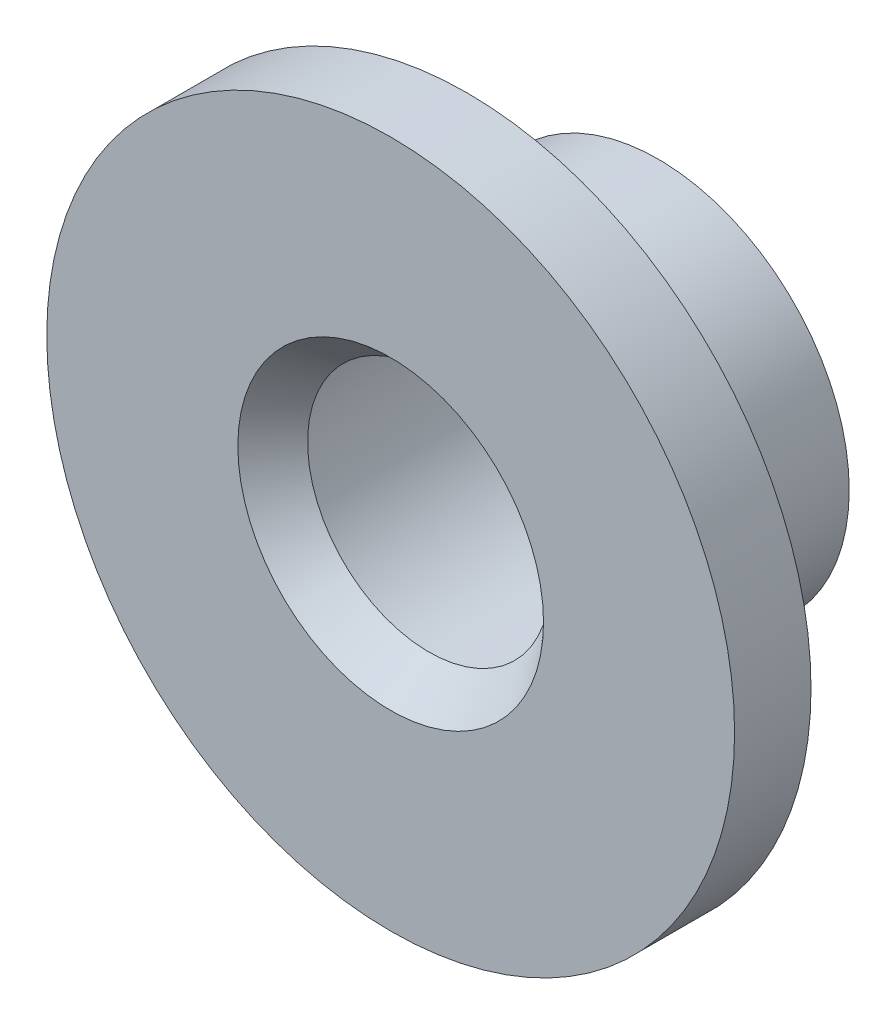
ISO-10303-21;
HEADER;
FILE_DESCRIPTION(('STEP AP214'),'2;1');
FILE_NAME('part.step','',(''),(''),'','','');
FILE_SCHEMA(('AUTOMOTIVE_DESIGN { 1 0 10303 214 1 1 1 1 }'));
ENDSEC;
DATA;
#1=APPLICATION_CONTEXT('core data for automotive mechanical design processes');
#2=APPLICATION_PROTOCOL_DEFINITION('international standard','automotive_design',2000,#1);
#3=PRODUCT_CONTEXT('',#1,'mechanical');
#4=PRODUCT('Part','Part','',(#3));
#5=PRODUCT_RELATED_PRODUCT_CATEGORY('part','',(#4));
#6=PRODUCT_DEFINITION_FORMATION('','',#4);
#7=PRODUCT_DEFINITION_CONTEXT('part definition',#1,'design');
#8=PRODUCT_DEFINITION('design','',#6,#7);
#9=PRODUCT_DEFINITION_SHAPE('','',#8);
#10=(LENGTH_UNIT() NAMED_UNIT(*) SI_UNIT(.MILLI.,.METRE.));
#11=(NAMED_UNIT(*) PLANE_ANGLE_UNIT() SI_UNIT($,.RADIAN.));
#12=(NAMED_UNIT(*) SI_UNIT($,.STERADIAN.) SOLID_ANGLE_UNIT());
#13=UNCERTAINTY_MEASURE_WITH_UNIT(LENGTH_MEASURE(1.E-05),#10,'distance_accuracy_value','');
#14=(GEOMETRIC_REPRESENTATION_CONTEXT(3) GLOBAL_UNCERTAINTY_ASSIGNED_CONTEXT((#13)) GLOBAL_UNIT_ASSIGNED_CONTEXT((#10,
#11,#12)) REPRESENTATION_CONTEXT('',''));
#15=CARTESIAN_POINT('',(0.,0.,0.));
#16=DIRECTION('',(0.,0.,1.));
#17=DIRECTION('',(1.,0.,0.));
#18=AXIS2_PLACEMENT_3D('',#15,#16,#17);
#19=CARTESIAN_POINT('',(0.,0.,0.));
#20=DIRECTION('',(0.,0.,1.));
#21=DIRECTION('',(1.,0.,0.));
#22=AXIS2_PLACEMENT_3D('',#19,#20,#21);
#23=CYLINDRICAL_SURFACE('',#22,18.);
#24=CARTESIAN_POINT('',(0.,0.,0.));
#25=DIRECTION('',(0.,0.,1.));
#26=DIRECTION('',(1.,0.,0.));
#27=AXIS2_PLACEMENT_3D('',#24,#25,#26);
#28=CIRCLE('',#27,18.);
#29=CARTESIAN_POINT('',(18.,0.,0.));
#30=VERTEX_POINT('',#29);
#31=EDGE_CURVE('E10',#30,#30,#28,.T.);
#32=ORIENTED_EDGE('',*,*,#31,.F.);
#33=EDGE_LOOP('',(#32));
#34=FACE_BOUND('',#33,.T.);
#35=CARTESIAN_POINT('',(0.,0.,-4.));
#36=DIRECTION('',(0.,0.,1.));
#37=DIRECTION('',(1.,0.,0.));
#38=AXIS2_PLACEMENT_3D('',#35,#36,#37);
#39=CIRCLE('',#38,18.);
#40=CARTESIAN_POINT('',(18.,0.,-4.));
#41=VERTEX_POINT('',#40);
#42=EDGE_CURVE('E60',#41,#41,#39,.T.);
#43=ORIENTED_EDGE('',*,*,#42,.T.);
#44=EDGE_LOOP('',(#43));
#45=FACE_BOUND('',#44,.T.);
#46=ADVANCED_FACE('F32',(#34,#45),#23,.T.);
#47=CARTESIAN_POINT('',(0.,18.,0.));
#48=DIRECTION('',(0.,0.,-1.));
#49=DIRECTION('',(-1.,0.,0.));
#50=AXIS2_PLACEMENT_3D('',#47,#48,#49);
#51=PLANE('',#50);
#52=CARTESIAN_POINT('',(0.,0.,0.));
#53=DIRECTION('',(0.,0.,1.));
#54=DIRECTION('',(1.,0.,0.));
#55=AXIS2_PLACEMENT_3D('',#52,#53,#54);
#56=CIRCLE('',#55,8.);
#57=CARTESIAN_POINT('',(8.,0.,0.));
#58=VERTEX_POINT('',#57);
#59=EDGE_CURVE('E38',#58,#58,#56,.T.);
#60=ORIENTED_EDGE('',*,*,#59,.F.);
#61=EDGE_LOOP('',(#60));
#62=FACE_BOUND('',#61,.T.);
#63=ORIENTED_EDGE('',*,*,#31,.T.);
#64=EDGE_LOOP('',(#63));
#65=FACE_BOUND('',#64,.T.);
#66=ADVANCED_FACE('F97',(#62,#65),#51,.F.);
#67=CARTESIAN_POINT('',(0.,0.,0.));
#68=DIRECTION('',(0.,0.,1.));
#69=DIRECTION('',(1.,0.,0.));
#70=AXIS2_PLACEMENT_3D('',#67,#68,#69);
#71=CONICAL_SURFACE('',#70,8.,0.689800044733608);
#72=CARTESIAN_POINT('',(0.,0.,-2.));
#73=DIRECTION('',(0.,0.,1.));
#74=DIRECTION('',(1.,0.,0.));
#75=AXIS2_PLACEMENT_3D('',#72,#73,#74);
#76=CIRCLE('',#75,6.35);
#77=CARTESIAN_POINT('',(6.35,0.,-2.));
#78=VERTEX_POINT('',#77);
#79=EDGE_CURVE('E42',#78,#78,#76,.T.);
#80=ORIENTED_EDGE('',*,*,#79,.F.);
#81=EDGE_LOOP('',(#80));
#82=FACE_BOUND('',#81,.T.);
#83=ORIENTED_EDGE('',*,*,#59,.T.);
#84=EDGE_LOOP('',(#83));
#85=FACE_BOUND('',#84,.T.);
#86=ADVANCED_FACE('F92',(#82,#85),#71,.F.);
#87=CARTESIAN_POINT('',(0.,6.35,-2.));
#88=DIRECTION('',(0.,0.,1.));
#89=DIRECTION('',(1.,0.,0.));
#90=AXIS2_PLACEMENT_3D('',#87,#88,#89);
#91=PLANE('',#90);
#92=CARTESIAN_POINT('',(0.,0.,-2.));
#93=DIRECTION('',(0.,0.,1.));
#94=DIRECTION('',(1.,0.,0.));
#95=AXIS2_PLACEMENT_3D('',#92,#93,#94);
#96=CIRCLE('',#95,8.);
#97=CARTESIAN_POINT('',(8.,0.,-2.));
#98=VERTEX_POINT('',#97);
#99=EDGE_CURVE('E46',#98,#98,#96,.T.);
#100=ORIENTED_EDGE('',*,*,#99,.F.);
#101=EDGE_LOOP('',(#100));
#102=FACE_BOUND('',#101,.T.);
#103=ORIENTED_EDGE('',*,*,#79,.T.);
#104=EDGE_LOOP('',(#103));
#105=FACE_BOUND('',#104,.T.);
#106=ADVANCED_FACE('F86',(#102,#105),#91,.F.);
#107=CARTESIAN_POINT('',(0.,0.,0.));
#108=DIRECTION('',(0.,0.,1.));
#109=DIRECTION('',(1.,0.,0.));
#110=AXIS2_PLACEMENT_3D('',#107,#108,#109);
#111=CYLINDRICAL_SURFACE('',#110,8.);
#112=CARTESIAN_POINT('',(0.,0.,-14.));
#113=DIRECTION('',(0.,0.,1.));
#114=DIRECTION('',(1.,0.,0.));
#115=AXIS2_PLACEMENT_3D('',#112,#113,#114);
#116=CIRCLE('',#115,8.);
#117=CARTESIAN_POINT('',(8.,0.,-14.));
#118=VERTEX_POINT('',#117);
#119=EDGE_CURVE('E51',#118,#118,#116,.T.);
#120=ORIENTED_EDGE('',*,*,#119,.F.);
#121=EDGE_LOOP('',(#120));
#122=FACE_BOUND('',#121,.T.);
#123=ORIENTED_EDGE('',*,*,#99,.T.);
#124=EDGE_LOOP('',(#123));
#125=FACE_BOUND('',#124,.T.);
#126=ADVANCED_FACE('F80',(#122,#125),#111,.F.);
#127=CARTESIAN_POINT('',(0.,8.,-14.));
#128=DIRECTION('',(0.,0.,1.));
#129=DIRECTION('',(1.,0.,0.));
#130=AXIS2_PLACEMENT_3D('',#127,#128,#129);
#131=PLANE('',#130);
#132=CARTESIAN_POINT('',(0.,0.,-14.));
#133=DIRECTION('',(0.,0.,1.));
#134=DIRECTION('',(1.,0.,0.));
#135=AXIS2_PLACEMENT_3D('',#132,#133,#134);
#136=CIRCLE('',#135,10.);
#137=CARTESIAN_POINT('',(10.,0.,-14.));
#138=VERTEX_POINT('',#137);
#139=EDGE_CURVE('E54',#138,#138,#136,.T.);
#140=ORIENTED_EDGE('',*,*,#139,.F.);
#141=EDGE_LOOP('',(#140));
#142=FACE_BOUND('',#141,.T.);
#143=ORIENTED_EDGE('',*,*,#119,.T.);
#144=EDGE_LOOP('',(#143));
#145=FACE_BOUND('',#144,.T.);
#146=ADVANCED_FACE('F74',(#142,#145),#131,.F.);
#147=CARTESIAN_POINT('',(0.,0.,0.));
#148=DIRECTION('',(0.,0.,1.));
#149=DIRECTION('',(1.,0.,0.));
#150=AXIS2_PLACEMENT_3D('',#147,#148,#149);
#151=CYLINDRICAL_SURFACE('',#150,10.);
#152=CARTESIAN_POINT('',(0.,0.,-4.));
#153=DIRECTION('',(0.,0.,1.));
#154=DIRECTION('',(1.,0.,0.));
#155=AXIS2_PLACEMENT_3D('',#152,#153,#154);
#156=CIRCLE('',#155,10.);
#157=CARTESIAN_POINT('',(10.,0.,-4.));
#158=VERTEX_POINT('',#157);
#159=EDGE_CURVE('E57',#158,#158,#156,.T.);
#160=ORIENTED_EDGE('',*,*,#159,.F.);
#161=EDGE_LOOP('',(#160));
#162=FACE_BOUND('',#161,.T.);
#163=ORIENTED_EDGE('',*,*,#139,.T.);
#164=EDGE_LOOP('',(#163));
#165=FACE_BOUND('',#164,.T.);
#166=ADVANCED_FACE('F68',(#162,#165),#151,.T.);
#167=CARTESIAN_POINT('',(0.,10.,-4.));
#168=DIRECTION('',(0.,0.,1.));
#169=DIRECTION('',(1.,0.,0.));
#170=AXIS2_PLACEMENT_3D('',#167,#168,#169);
#171=PLANE('',#170);
#172=ORIENTED_EDGE('',*,*,#42,.F.);
#173=EDGE_LOOP('',(#172));
#174=FACE_BOUND('',#173,.T.);
#175=ORIENTED_EDGE('',*,*,#159,.T.);
#176=EDGE_LOOP('',(#175));
#177=FACE_BOUND('',#176,.T.);
#178=ADVANCED_FACE('F65',(#174,#177),#171,.F.);
#179=CLOSED_SHELL('',(#46,#66,#86,#106,#126,#146,#166,#178));
#180=MANIFOLD_SOLID_BREP('B2',#179);
#181=ADVANCED_BREP_SHAPE_REPRESENTATION('',(#18,#180),#14);
#182=SHAPE_DEFINITION_REPRESENTATION(#9,#181);
ENDSEC;
END-ISO-10303-21;
